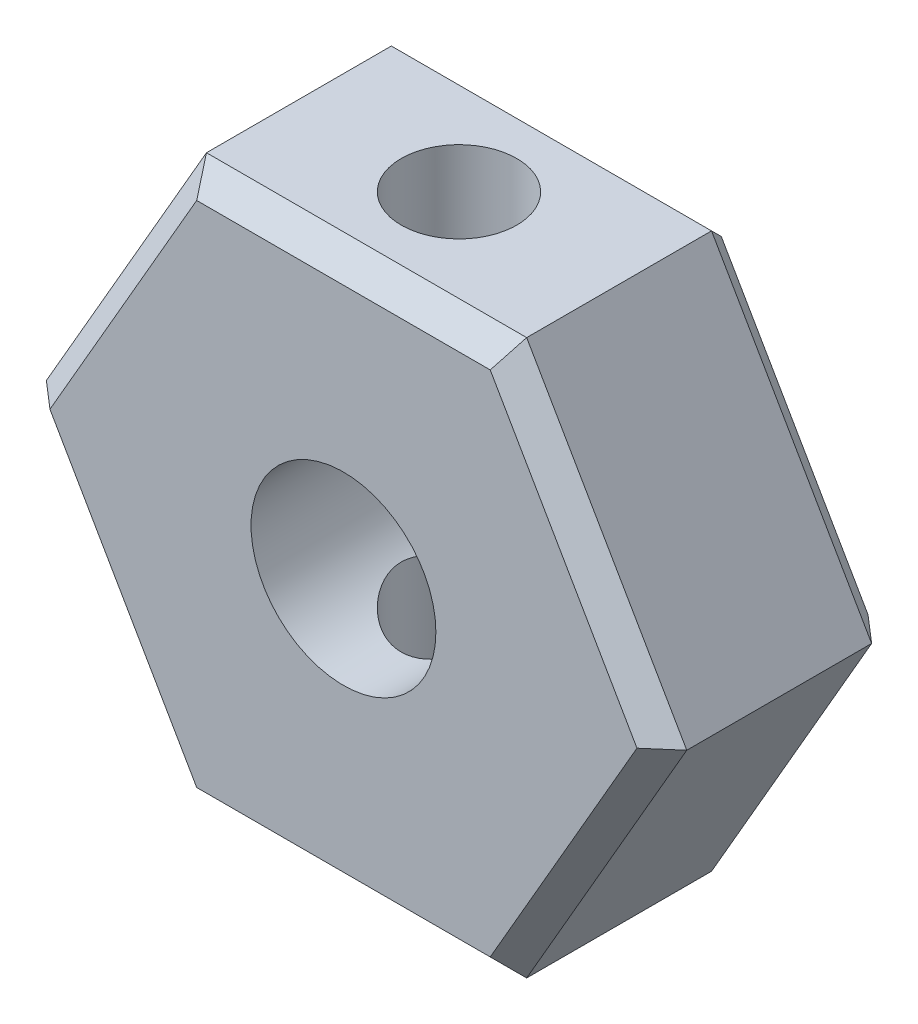
ISO-10303-21;
HEADER;
FILE_DESCRIPTION(('STEP AP214'),'2;1');
FILE_NAME('part.step','',(''),(''),'','','');
FILE_SCHEMA(('AUTOMOTIVE_DESIGN { 1 0 10303 214 1 1 1 1 }'));
ENDSEC;
DATA;
#1=APPLICATION_CONTEXT('core data for automotive mechanical design processes');
#2=APPLICATION_PROTOCOL_DEFINITION('international standard','automotive_design',2000,#1);
#3=PRODUCT_CONTEXT('',#1,'mechanical');
#4=PRODUCT('Part','Part','',(#3));
#5=PRODUCT_RELATED_PRODUCT_CATEGORY('part','',(#4));
#6=PRODUCT_DEFINITION_FORMATION('','',#4);
#7=PRODUCT_DEFINITION_CONTEXT('part definition',#1,'design');
#8=PRODUCT_DEFINITION('design','',#6,#7);
#9=PRODUCT_DEFINITION_SHAPE('','',#8);
#10=(LENGTH_UNIT() NAMED_UNIT(*) SI_UNIT(.MILLI.,.METRE.));
#11=(NAMED_UNIT(*) PLANE_ANGLE_UNIT() SI_UNIT($,.RADIAN.));
#12=(NAMED_UNIT(*) SI_UNIT($,.STERADIAN.) SOLID_ANGLE_UNIT());
#13=UNCERTAINTY_MEASURE_WITH_UNIT(LENGTH_MEASURE(1.E-05),#10,'distance_accuracy_value','');
#14=(GEOMETRIC_REPRESENTATION_CONTEXT(3) GLOBAL_UNCERTAINTY_ASSIGNED_CONTEXT((#13)) GLOBAL_UNIT_ASSIGNED_CONTEXT((#10,
#11,#12)) REPRESENTATION_CONTEXT('',''));
#15=CARTESIAN_POINT('',(0.,0.,0.));
#16=DIRECTION('',(0.,0.,1.));
#17=DIRECTION('',(1.,0.,0.));
#18=AXIS2_PLACEMENT_3D('',#15,#16,#17);
#19=CARTESIAN_POINT('',(3.46410161513776,-6.,5.));
#20=DIRECTION('',(-0.866025403784439,0.5,0.));
#21=DIRECTION('',(-0.5,-0.866025403784439,0.));
#22=AXIS2_PLACEMENT_3D('',#19,#20,#21);
#23=PLANE('',#22);
#24=DIRECTION('',(0.,0.,-1.));
#25=VECTOR('',#24,1.);
#26=CARTESIAN_POINT('',(3.46410161513776,-6.,5.));
#27=LINE('',#26,#25);
#28=CARTESIAN_POINT('',(3.46410161513776,-6.,4.49999999999999));
#29=VERTEX_POINT('',#28);
#30=CARTESIAN_POINT('',(3.46410161513776,-6.,0.499999999999998));
#31=VERTEX_POINT('',#30);
#32=EDGE_CURVE('E149',#29,#31,#27,.T.);
#33=ORIENTED_EDGE('',*,*,#32,.T.);
#34=DIRECTION('',(0.5,0.866025403784439,0.));
#35=VECTOR('',#34,1.);
#36=CARTESIAN_POINT('',(3.46410161513776,-6.,0.499999999999998));
#37=LINE('',#36,#35);
#38=CARTESIAN_POINT('',(6.92820323027551,0.,0.499999999999996));
#39=VERTEX_POINT('',#38);
#40=EDGE_CURVE('E151',#31,#39,#37,.T.);
#41=ORIENTED_EDGE('',*,*,#40,.T.);
#42=DIRECTION('',(0.,0.,-1.));
#43=VECTOR('',#42,1.);
#44=CARTESIAN_POINT('',(6.92820323027551,0.,5.));
#45=LINE('',#44,#43);
#46=CARTESIAN_POINT('',(6.92820323027551,0.,4.49999999999999));
#47=VERTEX_POINT('',#46);
#48=EDGE_CURVE('E144',#47,#39,#45,.T.);
#49=ORIENTED_EDGE('',*,*,#48,.F.);
#50=DIRECTION('',(-0.5,-0.866025403784439,0.));
#51=VECTOR('',#50,1.);
#52=CARTESIAN_POINT('',(3.46410161513776,-6.,4.49999999999999));
#53=LINE('',#52,#51);
#54=EDGE_CURVE('E129',#47,#29,#53,.T.);
#55=ORIENTED_EDGE('',*,*,#54,.T.);
#56=EDGE_LOOP('',(#33,#41,#49,#55));
#57=FACE_BOUND('',#56,.T.);
#58=ADVANCED_FACE('F32',(#57),#23,.F.);
#59=CARTESIAN_POINT('',(6.92820323027551,0.,5.));
#60=DIRECTION('',(-0.866025403784439,-0.5,0.));
#61=DIRECTION('',(0.5,-0.866025403784439,0.));
#62=AXIS2_PLACEMENT_3D('',#59,#60,#61);
#63=PLANE('',#62);
#64=ORIENTED_EDGE('',*,*,#48,.T.);
#65=DIRECTION('',(-0.5,0.866025403784439,0.));
#66=VECTOR('',#65,1.);
#67=CARTESIAN_POINT('',(6.92820323027551,0.,0.499999999999996));
#68=LINE('',#67,#66);
#69=CARTESIAN_POINT('',(3.46410161513776,6.,0.499999999999996));
#70=VERTEX_POINT('',#69);
#71=EDGE_CURVE('E204',#39,#70,#68,.T.);
#72=ORIENTED_EDGE('',*,*,#71,.T.);
#73=DIRECTION('',(0.,0.,-1.));
#74=VECTOR('',#73,1.);
#75=CARTESIAN_POINT('',(3.46410161513776,6.,5.));
#76=LINE('',#75,#74);
#77=CARTESIAN_POINT('',(3.46410161513776,6.,4.49999999999999));
#78=VERTEX_POINT('',#77);
#79=EDGE_CURVE('E172',#78,#70,#76,.T.);
#80=ORIENTED_EDGE('',*,*,#79,.F.);
#81=DIRECTION('',(0.5,-0.866025403784439,0.));
#82=VECTOR('',#81,1.);
#83=CARTESIAN_POINT('',(6.92820323027551,0.,4.49999999999999));
#84=LINE('',#83,#82);
#85=EDGE_CURVE('E202',#78,#47,#84,.T.);
#86=ORIENTED_EDGE('',*,*,#85,.T.);
#87=EDGE_LOOP('',(#64,#72,#80,#86));
#88=FACE_BOUND('',#87,.T.);
#89=ADVANCED_FACE('F260',(#88),#63,.F.);
#90=CARTESIAN_POINT('',(3.46410161513776,6.,5.));
#91=DIRECTION('',(0.,-1.,0.));
#92=DIRECTION('',(1.,0.,0.));
#93=AXIS2_PLACEMENT_3D('',#90,#91,#92);
#94=PLANE('',#93);
#95=CARTESIAN_POINT('',(0.,6.,2.5));
#96=DIRECTION('',(0.,1.,0.));
#97=DIRECTION('',(-1.,0.,0.));
#98=AXIS2_PLACEMENT_3D('',#95,#96,#97);
#99=CIRCLE('',#98,1.25);
#100=CARTESIAN_POINT('',(-1.25,6.,2.5));
#101=VERTEX_POINT('',#100);
#102=EDGE_CURVE('E384',#101,#101,#99,.T.);
#103=ORIENTED_EDGE('',*,*,#102,.F.);
#104=EDGE_LOOP('',(#103));
#105=FACE_BOUND('',#104,.T.);
#106=ORIENTED_EDGE('',*,*,#79,.T.);
#107=DIRECTION('',(-1.,0.,0.));
#108=VECTOR('',#107,1.);
#109=CARTESIAN_POINT('',(3.46410161513776,6.,0.499999999999997));
#110=LINE('',#109,#108);
#111=CARTESIAN_POINT('',(-3.46410161513776,6.,0.499999999999997));
#112=VERTEX_POINT('',#111);
#113=EDGE_CURVE('E200',#70,#112,#110,.T.);
#114=ORIENTED_EDGE('',*,*,#113,.T.);
#115=DIRECTION('',(0.,0.,-1.));
#116=VECTOR('',#115,1.);
#117=CARTESIAN_POINT('',(-3.46410161513776,6.,5.));
#118=LINE('',#117,#116);
#119=CARTESIAN_POINT('',(-3.46410161513776,6.,4.49999999999999));
#120=VERTEX_POINT('',#119);
#121=EDGE_CURVE('E169',#120,#112,#118,.T.);
#122=ORIENTED_EDGE('',*,*,#121,.F.);
#123=DIRECTION('',(1.,0.,0.));
#124=VECTOR('',#123,1.);
#125=CARTESIAN_POINT('',(3.46410161513776,6.,4.49999999999999));
#126=LINE('',#125,#124);
#127=EDGE_CURVE('E198',#120,#78,#126,.T.);
#128=ORIENTED_EDGE('',*,*,#127,.T.);
#129=EDGE_LOOP('',(#106,#114,#122,#128));
#130=FACE_BOUND('',#129,.T.);
#131=ADVANCED_FACE('F265',(#105,#130),#94,.F.);
#132=CARTESIAN_POINT('',(-3.46410161513776,6.,5.));
#133=DIRECTION('',(0.866025403784439,-0.5,0.));
#134=DIRECTION('',(0.5,0.866025403784439,0.));
#135=AXIS2_PLACEMENT_3D('',#132,#133,#134);
#136=PLANE('',#135);
#137=ORIENTED_EDGE('',*,*,#121,.T.);
#138=DIRECTION('',(-0.5,-0.866025403784439,0.));
#139=VECTOR('',#138,1.);
#140=CARTESIAN_POINT('',(-3.46410161513776,6.,0.499999999999997));
#141=LINE('',#140,#139);
#142=CARTESIAN_POINT('',(-6.92820323027551,0.,0.499999999999997));
#143=VERTEX_POINT('',#142);
#144=EDGE_CURVE('E196',#112,#143,#141,.T.);
#145=ORIENTED_EDGE('',*,*,#144,.T.);
#146=DIRECTION('',(0.,0.,-1.));
#147=VECTOR('',#146,1.);
#148=CARTESIAN_POINT('',(-6.92820323027551,0.,5.));
#149=LINE('',#148,#147);
#150=CARTESIAN_POINT('',(-6.92820323027551,0.,4.49999999999999));
#151=VERTEX_POINT('',#150);
#152=EDGE_CURVE('E160',#151,#143,#149,.T.);
#153=ORIENTED_EDGE('',*,*,#152,.F.);
#154=DIRECTION('',(0.5,0.866025403784439,0.));
#155=VECTOR('',#154,1.);
#156=CARTESIAN_POINT('',(-3.46410161513776,6.,4.49999999999999));
#157=LINE('',#156,#155);
#158=EDGE_CURVE('E194',#151,#120,#157,.T.);
#159=ORIENTED_EDGE('',*,*,#158,.T.);
#160=EDGE_LOOP('',(#137,#145,#153,#159));
#161=FACE_BOUND('',#160,.T.);
#162=ADVANCED_FACE('F321',(#161),#136,.F.);
#163=CARTESIAN_POINT('',(-6.92820323027551,0.,5.));
#164=DIRECTION('',(0.866025403784438,0.5,0.));
#165=DIRECTION('',(-0.5,0.866025403784439,0.));
#166=AXIS2_PLACEMENT_3D('',#163,#164,#165);
#167=PLANE('',#166);
#168=ORIENTED_EDGE('',*,*,#152,.T.);
#169=DIRECTION('',(0.5,-0.866025403784439,0.));
#170=VECTOR('',#169,1.);
#171=CARTESIAN_POINT('',(-6.92820323027551,0.,0.499999999999998));
#172=LINE('',#171,#170);
#173=CARTESIAN_POINT('',(-3.46410161513775,-6.,0.499999999999998));
#174=VERTEX_POINT('',#173);
#175=EDGE_CURVE('E192',#143,#174,#172,.T.);
#176=ORIENTED_EDGE('',*,*,#175,.T.);
#177=DIRECTION('',(0.,0.,-1.));
#178=VECTOR('',#177,1.);
#179=CARTESIAN_POINT('',(-3.46410161513775,-6.,5.));
#180=LINE('',#179,#178);
#181=CARTESIAN_POINT('',(-3.46410161513775,-6.,4.49999999999999));
#182=VERTEX_POINT('',#181);
#183=EDGE_CURVE('E157',#182,#174,#180,.T.);
#184=ORIENTED_EDGE('',*,*,#183,.F.);
#185=DIRECTION('',(-0.5,0.866025403784439,0.));
#186=VECTOR('',#185,1.);
#187=CARTESIAN_POINT('',(-6.92820323027551,0.,4.49999999999999));
#188=LINE('',#187,#186);
#189=EDGE_CURVE('E190',#182,#151,#188,.T.);
#190=ORIENTED_EDGE('',*,*,#189,.T.);
#191=EDGE_LOOP('',(#168,#176,#184,#190));
#192=FACE_BOUND('',#191,.T.);
#193=ADVANCED_FACE('F341',(#192),#167,.F.);
#194=CARTESIAN_POINT('',(-3.46410161513775,-6.,5.));
#195=DIRECTION('',(0.,1.,0.));
#196=DIRECTION('',(0.,0.,1.));
#197=AXIS2_PLACEMENT_3D('',#194,#195,#196);
#198=PLANE('',#197);
#199=CARTESIAN_POINT('',(0.,-6.00000000000001,2.5));
#200=DIRECTION('',(0.,1.,0.));
#201=DIRECTION('',(-1.,0.,0.));
#202=AXIS2_PLACEMENT_3D('',#199,#200,#201);
#203=CIRCLE('',#202,1.25);
#204=CARTESIAN_POINT('',(-1.25,-6.00000000000001,2.5));
#205=VERTEX_POINT('',#204);
#206=EDGE_CURVE('E243',#205,#205,#203,.T.);
#207=ORIENTED_EDGE('',*,*,#206,.T.);
#208=EDGE_LOOP('',(#207));
#209=FACE_BOUND('',#208,.T.);
#210=ORIENTED_EDGE('',*,*,#183,.T.);
#211=DIRECTION('',(1.,0.,0.));
#212=VECTOR('',#211,1.);
#213=CARTESIAN_POINT('',(-3.46410161513775,-6.,0.499999999999997));
#214=LINE('',#213,#212);
#215=EDGE_CURVE('E143',#174,#31,#214,.T.);
#216=ORIENTED_EDGE('',*,*,#215,.T.);
#217=ORIENTED_EDGE('',*,*,#32,.F.);
#218=DIRECTION('',(-1.,0.,0.));
#219=VECTOR('',#218,1.);
#220=CARTESIAN_POINT('',(-3.46410161513775,-6.,4.49999999999999));
#221=LINE('',#220,#219);
#222=EDGE_CURVE('E136',#29,#182,#221,.T.);
#223=ORIENTED_EDGE('',*,*,#222,.T.);
#224=EDGE_LOOP('',(#210,#216,#217,#223));
#225=FACE_BOUND('',#224,.T.);
#226=ADVANCED_FACE('F155',(#209,#225),#198,.F.);
#227=CARTESIAN_POINT('',(0.,0.,5.));
#228=DIRECTION('',(0.,0.,1.));
#229=DIRECTION('',(1.,0.,0.));
#230=AXIS2_PLACEMENT_3D('',#227,#228,#229);
#231=PLANE('',#230);
#232=DIRECTION('',(1.,0.,0.));
#233=VECTOR('',#232,1.);
#234=CARTESIAN_POINT('',(3.46410161513776,-5.5,5.));
#235=LINE('',#234,#233);
#236=CARTESIAN_POINT('',(-3.17542648054294,-5.5,5.));
#237=VERTEX_POINT('',#236);
#238=CARTESIAN_POINT('',(3.17542648054294,-5.5,5.));
#239=VERTEX_POINT('',#238);
#240=EDGE_CURVE('E45',#237,#239,#235,.T.);
#241=ORIENTED_EDGE('',*,*,#240,.T.);
#242=DIRECTION('',(0.5,0.866025403784439,0.));
#243=VECTOR('',#242,1.);
#244=CARTESIAN_POINT('',(6.49519052838329,0.250000000000003,5.));
#245=LINE('',#244,#243);
#246=CARTESIAN_POINT('',(6.35085296108589,0.,5.));
#247=VERTEX_POINT('',#246);
#248=EDGE_CURVE('E11',#239,#247,#245,.T.);
#249=ORIENTED_EDGE('',*,*,#248,.T.);
#250=DIRECTION('',(-0.5,0.866025403784439,0.));
#251=VECTOR('',#250,1.);
#252=CARTESIAN_POINT('',(3.03108891324554,5.75,5.));
#253=LINE('',#252,#251);
#254=CARTESIAN_POINT('',(3.17542648054294,5.5,5.));
#255=VERTEX_POINT('',#254);
#256=EDGE_CURVE('E206',#247,#255,#253,.T.);
#257=ORIENTED_EDGE('',*,*,#256,.T.);
#258=DIRECTION('',(-1.,0.,0.));
#259=VECTOR('',#258,1.);
#260=CARTESIAN_POINT('',(-3.46410161513776,5.5,5.));
#261=LINE('',#260,#259);
#262=CARTESIAN_POINT('',(-3.17542648054295,5.5,5.));
#263=VERTEX_POINT('',#262);
#264=EDGE_CURVE('E208',#255,#263,#261,.T.);
#265=ORIENTED_EDGE('',*,*,#264,.T.);
#266=DIRECTION('',(-0.5,-0.866025403784439,0.));
#267=VECTOR('',#266,1.);
#268=CARTESIAN_POINT('',(-6.49519052838329,-0.250000000000002,5.));
#269=LINE('',#268,#267);
#270=CARTESIAN_POINT('',(-6.35085296108588,0.,5.));
#271=VERTEX_POINT('',#270);
#272=EDGE_CURVE('E210',#263,#271,#269,.T.);
#273=ORIENTED_EDGE('',*,*,#272,.T.);
#274=DIRECTION('',(0.5,-0.866025403784439,0.));
#275=VECTOR('',#274,1.);
#276=CARTESIAN_POINT('',(-3.03108891324553,-5.75,5.));
#277=LINE('',#276,#275);
#278=EDGE_CURVE('E56',#271,#237,#277,.T.);
#279=ORIENTED_EDGE('',*,*,#278,.T.);
#280=EDGE_LOOP('',(#241,#249,#257,#265,#273,#279));
#281=FACE_BOUND('',#280,.T.);
#282=CARTESIAN_POINT('',(0.,0.,5.));
#283=DIRECTION('',(0.,0.,1.));
#284=DIRECTION('',(1.,0.,0.));
#285=AXIS2_PLACEMENT_3D('',#282,#283,#284);
#286=CIRCLE('',#285,2.);
#287=CARTESIAN_POINT('',(2.,0.,5.));
#288=VERTEX_POINT('',#287);
#289=EDGE_CURVE('E163',#288,#288,#286,.T.);
#290=ORIENTED_EDGE('',*,*,#289,.F.);
#291=EDGE_LOOP('',(#290));
#292=FACE_BOUND('',#291,.T.);
#293=ADVANCED_FACE('F350',(#281,#292),#231,.T.);
#294=CARTESIAN_POINT('',(0.,0.,0.));
#295=DIRECTION('',(0.,0.,1.));
#296=DIRECTION('',(1.,0.,0.));
#297=AXIS2_PLACEMENT_3D('',#294,#295,#296);
#298=PLANE('',#297);
#299=DIRECTION('',(-0.5,-0.866025403784439,0.));
#300=VECTOR('',#299,1.);
#301=CARTESIAN_POINT('',(4.76313972081442,-2.75,0.));
#302=LINE('',#301,#300);
#303=CARTESIAN_POINT('',(6.35085296108589,0.,0.));
#304=VERTEX_POINT('',#303);
#305=CARTESIAN_POINT('',(3.17542648054294,-5.5,0.));
#306=VERTEX_POINT('',#305);
#307=EDGE_CURVE('E185',#304,#306,#302,.T.);
#308=ORIENTED_EDGE('',*,*,#307,.T.);
#309=DIRECTION('',(-1.,0.,0.));
#310=VECTOR('',#309,1.);
#311=CARTESIAN_POINT('',(0.,-5.5,0.));
#312=LINE('',#311,#310);
#313=CARTESIAN_POINT('',(-3.17542648054294,-5.5,0.));
#314=VERTEX_POINT('',#313);
#315=EDGE_CURVE('E152',#306,#314,#312,.T.);
#316=ORIENTED_EDGE('',*,*,#315,.T.);
#317=DIRECTION('',(-0.5,0.866025403784439,0.));
#318=VECTOR('',#317,1.);
#319=CARTESIAN_POINT('',(-4.76313972081442,-2.75,0.));
#320=LINE('',#319,#318);
#321=CARTESIAN_POINT('',(-6.35085296108589,0.,0.));
#322=VERTEX_POINT('',#321);
#323=EDGE_CURVE('E183',#314,#322,#320,.T.);
#324=ORIENTED_EDGE('',*,*,#323,.T.);
#325=DIRECTION('',(0.5,0.866025403784439,0.));
#326=VECTOR('',#325,1.);
#327=CARTESIAN_POINT('',(-4.76313972081442,2.75,0.));
#328=LINE('',#327,#326);
#329=CARTESIAN_POINT('',(-3.17542648054295,5.5,0.));
#330=VERTEX_POINT('',#329);
#331=EDGE_CURVE('E181',#322,#330,#328,.T.);
#332=ORIENTED_EDGE('',*,*,#331,.T.);
#333=DIRECTION('',(1.,0.,0.));
#334=VECTOR('',#333,1.);
#335=CARTESIAN_POINT('',(0.,5.5,0.));
#336=LINE('',#335,#334);
#337=CARTESIAN_POINT('',(3.17542648054294,5.5,0.));
#338=VERTEX_POINT('',#337);
#339=EDGE_CURVE('E179',#330,#338,#336,.T.);
#340=ORIENTED_EDGE('',*,*,#339,.T.);
#341=DIRECTION('',(0.5,-0.866025403784439,0.));
#342=VECTOR('',#341,1.);
#343=CARTESIAN_POINT('',(4.76313972081442,2.75,0.));
#344=LINE('',#343,#342);
#345=EDGE_CURVE('E177',#338,#304,#344,.T.);
#346=ORIENTED_EDGE('',*,*,#345,.T.);
#347=EDGE_LOOP('',(#308,#316,#324,#332,#340,#346));
#348=FACE_BOUND('',#347,.T.);
#349=CARTESIAN_POINT('',(0.,0.,0.));
#350=DIRECTION('',(0.,0.,1.));
#351=DIRECTION('',(1.,0.,0.));
#352=AXIS2_PLACEMENT_3D('',#349,#350,#351);
#353=CIRCLE('',#352,2.);
#354=CARTESIAN_POINT('',(2.,0.,0.));
#355=VERTEX_POINT('',#354);
#356=EDGE_CURVE('E158',#355,#355,#353,.T.);
#357=ORIENTED_EDGE('',*,*,#356,.T.);
#358=EDGE_LOOP('',(#357));
#359=FACE_BOUND('',#358,.T.);
#360=ADVANCED_FACE('F334',(#348,#359),#298,.F.);
#361=CARTESIAN_POINT('',(0.,0.,0.));
#362=DIRECTION('',(0.,0.,1.));
#363=DIRECTION('',(1.,0.,0.));
#364=AXIS2_PLACEMENT_3D('',#361,#362,#363);
#365=CYLINDRICAL_SURFACE('',#364,2.);
#366=CARTESIAN_POINT('',(-1.25,-1.5612494995996,2.5));
#367=CARTESIAN_POINT('',(-1.24999462210485,-1.56125800072558,2.43787971819707));
#368=CARTESIAN_POINT('',(-1.24532693849665,-1.56502642708837,2.37566216462974));
#369=CARTESIAN_POINT('',(-1.22698950832934,-1.57943717205478,2.25332367992062));
#370=CARTESIAN_POINT('',(-1.21329530430551,-1.59009816464115,2.19320891363476));
#371=CARTESIAN_POINT('',(-1.17788073911871,-1.61650085329041,2.07721767730115));
#372=CARTESIAN_POINT('',(-1.15622993332784,-1.63219837418033,2.02130939131818));
#373=CARTESIAN_POINT('',(-1.10571945561924,-1.66682950714432,1.91399113836184));
#374=CARTESIAN_POINT('',(-1.07685958706091,-1.68576320748676,1.86258129414349));
#375=CARTESIAN_POINT('',(-1.00823937928364,-1.72779611374711,1.75813484552301));
#376=CARTESIAN_POINT('',(-0.967536093692501,-1.75111338227346,1.7058052591674));
#377=CARTESIAN_POINT('',(-0.878308664496878,-1.79752820854877,1.60811730085503));
#378=CARTESIAN_POINT('',(-0.829777781297412,-1.82062555863329,1.56276500271607));
#379=CARTESIAN_POINT('',(-0.719186665258489,-1.86729453891009,1.47489641485187));
#380=CARTESIAN_POINT('',(-0.656200568910555,-1.8905872224145,1.43338233189569));
#381=CARTESIAN_POINT('',(-0.522404070837314,-1.9318323169914,1.36187479523684));
#382=CARTESIAN_POINT('',(-0.45160150647824,-1.94979001179838,1.33186993424874));
#383=CARTESIAN_POINT('',(-0.311776878362017,-1.97669841318201,1.28751768939293));
#384=CARTESIAN_POINT('',(-0.243305636047239,-1.98637922422038,1.27188858360306));
#385=CARTESIAN_POINT('',(-0.104105100662262,-1.99850544379202,1.25236793035659));
#386=CARTESIAN_POINT('',(-0.0333782605640252,-2.00095845843657,1.24846404387944));
#387=CARTESIAN_POINT('',(0.098065828421342,-1.99852909107528,1.25235568927761));
#388=CARTESIAN_POINT('',(0.158852523273788,-1.99458699811902,1.2586513763009));
#389=CARTESIAN_POINT('',(0.278306645903671,-1.98145272261225,1.27986698436332));
#390=CARTESIAN_POINT('',(0.336973913146976,-1.97226014325117,1.29478755723751));
#391=CARTESIAN_POINT('',(0.450889117077074,-1.94938133614675,1.33260377509711));
#392=CARTESIAN_POINT('',(0.506127875493235,-1.93568361673912,1.35551982404859));
#393=CARTESIAN_POINT('',(0.612019220469384,-1.90485632889331,1.40846875525999));
#394=CARTESIAN_POINT('',(0.662670758560003,-1.88772597874226,1.4385032588906));
#395=CARTESIAN_POINT('',(0.764713515567043,-1.84893224750793,1.50902816532936));
#396=CARTESIAN_POINT('',(0.815412344918951,-1.82697004307144,1.55035462674233));
#397=CARTESIAN_POINT('',(0.9095985959055,-1.78195462752237,1.64013238022337));
#398=CARTESIAN_POINT('',(0.953075338789634,-1.75889986449171,1.68859402644654));
#399=CARTESIAN_POINT('',(1.03735445892932,-1.71071442112195,1.7987056229061));
#400=CARTESIAN_POINT('',(1.07706615479947,-1.68570581533195,1.8612513808503));
#401=CARTESIAN_POINT('',(1.14526153203309,-1.64014139095399,1.99364611977342));
#402=CARTESIAN_POINT('',(1.17376589603358,-1.61957740191679,2.06348134395541));
#403=CARTESIAN_POINT('',(1.21218566853166,-1.5909187656712,2.18976940288787));
#404=CARTESIAN_POINT('',(1.22501841721721,-1.58096704305272,2.24491096263767));
#405=CARTESIAN_POINT('',(1.24310168537523,-1.56679138875765,2.35711518874893));
#406=CARTESIAN_POINT('',(1.24836256353275,-1.56255963237428,2.41417512103989));
#407=CARTESIAN_POINT('',(1.25098535954508,-1.56046133530164,2.52872868054027));
#408=CARTESIAN_POINT('',(1.24832917576576,-1.56260938140435,2.58622300136582));
#409=CARTESIAN_POINT('',(1.23525733555987,-1.57296042862705,2.6997805810316));
#410=CARTESIAN_POINT('',(1.22483525320262,-1.58116844404656,2.75584261496292));
#411=CARTESIAN_POINT('',(1.1970493572483,-1.60230060601957,2.8642183838658));
#412=CARTESIAN_POINT('',(1.17980280626788,-1.61514477937171,2.91657867333151));
#413=CARTESIAN_POINT('',(1.13902451938523,-1.64415573440841,3.01778733455698));
#414=CARTESIAN_POINT('',(1.11549055271421,-1.66032369489908,3.06663445202449));
#415=CARTESIAN_POINT('',(1.0576537677232,-1.69787203988937,3.16930603917703));
#416=CARTESIAN_POINT('',(1.02215373814221,-1.71965875738289,3.22230754124932));
#417=CARTESIAN_POINT('',(0.943690263224863,-1.76393958000711,3.32218505243914));
#418=CARTESIAN_POINT('',(0.900719074496601,-1.78643439903354,3.36905461697796));
#419=CARTESIAN_POINT('',(0.800380659499195,-1.83383164018972,3.46298324624315));
#420=CARTESIAN_POINT('',(0.741809949714164,-1.85854204787597,3.50886855700767));
#421=CARTESIAN_POINT('',(0.616299987869578,-1.90384248964999,3.59006865187585));
#422=CARTESIAN_POINT('',(0.549364678748662,-1.92443445329133,3.62538838997364));
#423=CARTESIAN_POINT('',(0.4129259006366,-1.95809255957561,3.68199499120263));
#424=CARTESIAN_POINT('',(0.343814822544519,-1.9715348458918,3.70399420647076));
#425=CARTESIAN_POINT('',(0.201860998884746,-1.9910701008804,3.73572666868108));
#426=CARTESIAN_POINT('',(0.129023563238367,-1.99717323933003,3.74547688976111));
#427=CARTESIAN_POINT('',(-0.00659907199681211,-2.00096685748559,3.75154652003878));
#428=CARTESIAN_POINT('',(-0.0692812975954738,-1.99976600623617,3.74963577678698));
#429=CARTESIAN_POINT('',(-0.193279811091725,-1.99160739958772,3.73653832502566));
#430=CARTESIAN_POINT('',(-0.254596160840743,-1.98464990541518,3.72535203742423));
#431=CARTESIAN_POINT('',(-0.372043294685526,-1.9659610468898,3.6948395251234));
#432=CARTESIAN_POINT('',(-0.428280180678309,-1.95440367471701,3.67580916012679));
#433=CARTESIAN_POINT('',(-0.536714369111315,-1.92744968677265,3.63044007183593));
#434=CARTESIAN_POINT('',(-0.58891098811824,-1.91205242331406,3.60410011552441));
#435=CARTESIAN_POINT('',(-0.693656737470666,-1.87675342239825,3.54183942100879));
#436=CARTESIAN_POINT('',(-0.745680127162211,-1.85655002466956,3.50520801868101));
#437=CARTESIAN_POINT('',(-0.843216608355413,-1.81433640456238,3.4249233696673));
#438=CARTESIAN_POINT('',(-0.88872224305523,-1.7923241573062,3.38126219975405));
#439=CARTESIAN_POINT('',(-0.978723601300805,-1.74500415099525,3.28088373769672));
#440=CARTESIAN_POINT('',(-1.02212829873816,-1.71967871446314,3.22319165482308));
#441=CARTESIAN_POINT('',(-1.09877325005744,-1.67174821497037,3.10035533398988));
#442=CARTESIAN_POINT('',(-1.132019125571,-1.64914165167051,3.0352152450924));
#443=CARTESIAN_POINT('',(-1.18099110923231,-1.61429776080214,2.91359723207033));
#444=CARTESIAN_POINT('',(-1.19896216276381,-1.60087340349652,2.85836431912063));
#445=CARTESIAN_POINT('',(-1.22712822180407,-1.57939158437939,2.7450307220428));
#446=CARTESIAN_POINT('',(-1.23734784245404,-1.57131714400176,2.68693974497585));
#447=CARTESIAN_POINT('',(-1.24559906183097,-1.56476456389394,2.60696947613714));
#448=CARTESIAN_POINT('',(-1.24724671259581,-1.56345069546827,2.58563585448301));
#449=CARTESIAN_POINT('',(-1.24944824734288,-1.56169158695047,2.54287203347851));
#450=CARTESIAN_POINT('',(-1.25000185626673,-1.56124656529967,2.52144181119831));
#451=CARTESIAN_POINT('',(-1.25,-1.5612494995996,2.5));
#452=B_SPLINE_CURVE_WITH_KNOTS('',3,(#366,#367,#368,#369,#370,#371,#372,#373,#374,#375,#376,
#377,#378,#379,#380,#381,#382,#383,#384,#385,#386,#387,#388,#389,#390,#391,#392,#393,#394,#395,
#396,#397,#398,#399,#400,#401,#402,#403,#404,#405,#406,#407,#408,#409,#410,#411,#412,#413,#414,
#415,#416,#417,#418,#419,#420,#421,#422,#423,#424,#425,#426,#427,#428,#429,#430,#431,#432,#433,
#434,#435,#436,#437,#438,#439,#440,#441,#442,#443,#444,#445,#446,#447,#448,#449,#450,#451),
.UNSPECIFIED.,.T.,.F.,(4,2,2,2,2,2,2,2,2,2,2,2,2,2,2,2,2,2,2,2,2,2,2,2,2,2,2,2,2,2,2,2,2,2,2,2,
2,2,2,2,2,2,4),(0.,0.186262444012015,0.373031654397096,0.558205556130402,0.743384509377751,
0.953406207440074,1.16360970997911,1.39917236034457,1.6345009273926,1.84590412815398,
2.05708478092387,2.23992319583511,2.42277543076414,2.60609774825956,2.78946186128171,
2.99564504832107,3.20213044016186,3.43558067920821,3.66859805095278,3.84032775480268,
4.01182230007289,4.18370925240739,4.35573859160081,4.52493212343598,4.69418576487135,
4.89566333610129,5.09735098485254,5.33136598660889,5.56527109061626,5.78520080494549,
6.00482541258961,6.19203601525124,6.37923812308583,6.55994569114424,6.74068376037881,
6.94018144108746,7.13990556958868,7.36841817421249,7.59680409585386,7.77496902270413,
7.95256577963385,8.01684109069498,8.08113255947023),.UNSPECIFIED.);
#453=CARTESIAN_POINT('',(-1.25,-1.5612494995996,2.5));
#454=VERTEX_POINT('',#453);
#455=EDGE_CURVE('E36',#454,#454,#452,.T.);
#456=ORIENTED_EDGE('',*,*,#455,.T.);
#457=EDGE_LOOP('',(#456));
#458=FACE_BOUND('',#457,.T.);
#459=CARTESIAN_POINT('',(-1.25,1.5612494995996,2.5));
#460=CARTESIAN_POINT('',(-1.24999462210485,1.56125800072559,2.56212028180293));
#461=CARTESIAN_POINT('',(-1.24532693849666,1.56502642708837,2.62433783537025));
#462=CARTESIAN_POINT('',(-1.22698950832934,1.57943717205478,2.74667632007937));
#463=CARTESIAN_POINT('',(-1.21329530430551,1.59009816464115,2.80679108636523));
#464=CARTESIAN_POINT('',(-1.17788073911871,1.61650085329041,2.92278232269884));
#465=CARTESIAN_POINT('',(-1.15622993332784,1.63219837418033,2.97869060868181));
#466=CARTESIAN_POINT('',(-1.10571945561924,1.66682950714432,3.08600886163815));
#467=CARTESIAN_POINT('',(-1.07685958706091,1.68576320748676,3.1374187058565));
#468=CARTESIAN_POINT('',(-1.00823937928364,1.72779611374711,3.24186515447698));
#469=CARTESIAN_POINT('',(-0.967536093692502,1.75111338227346,3.29419474083259));
#470=CARTESIAN_POINT('',(-0.878308664496879,1.79752820854877,3.39188269914496));
#471=CARTESIAN_POINT('',(-0.829777781297413,1.82062555863329,3.43723499728392));
#472=CARTESIAN_POINT('',(-0.719186665258491,1.86729453891009,3.52510358514812));
#473=CARTESIAN_POINT('',(-0.656200568910556,1.8905872224145,3.5666176681043));
#474=CARTESIAN_POINT('',(-0.522404070837315,1.9318323169914,3.63812520476316));
#475=CARTESIAN_POINT('',(-0.451601506478241,1.94979001179838,3.66813006575125));
#476=CARTESIAN_POINT('',(-0.311776878362018,1.97669841318201,3.71248231060706));
#477=CARTESIAN_POINT('',(-0.243305636047241,1.98637922422038,3.72811141639693));
#478=CARTESIAN_POINT('',(-0.104105100662263,1.99850544379202,3.7476320696434));
#479=CARTESIAN_POINT('',(-0.0333782605640266,2.00095845843657,3.75153595612055));
#480=CARTESIAN_POINT('',(0.0980658284213406,1.99852909107528,3.74764431072238));
#481=CARTESIAN_POINT('',(0.158852523273786,1.99458699811902,3.74134862369909));
#482=CARTESIAN_POINT('',(0.27830664590367,1.98145272261225,3.72013301563667));
#483=CARTESIAN_POINT('',(0.336973913146974,1.97226014325117,3.70521244276248));
#484=CARTESIAN_POINT('',(0.450889117077073,1.94938133614675,3.66739622490288));
#485=CARTESIAN_POINT('',(0.506127875493233,1.93568361673912,3.64448017595141));
#486=CARTESIAN_POINT('',(0.612019220469382,1.90485632889331,3.59153124474001));
#487=CARTESIAN_POINT('',(0.662670758560001,1.88772597874226,3.56149674110939));
#488=CARTESIAN_POINT('',(0.764713515567042,1.84893224750793,3.49097183467063));
#489=CARTESIAN_POINT('',(0.81541234491895,1.82697004307144,3.44964537325766));
#490=CARTESIAN_POINT('',(0.909598595905499,1.78195462752237,3.35986761977662));
#491=CARTESIAN_POINT('',(0.953075338789632,1.75889986449171,3.31140597355345));
#492=CARTESIAN_POINT('',(1.03735445892932,1.71071442112195,3.20129437709389));
#493=CARTESIAN_POINT('',(1.07706615479946,1.68570581533195,3.13874861914969));
#494=CARTESIAN_POINT('',(1.14526153203309,1.64014139095399,3.00635388022657));
#495=CARTESIAN_POINT('',(1.17376589603358,1.6195774019168,2.93651865604458));
#496=CARTESIAN_POINT('',(1.21218566853166,1.5909187656712,2.81023059711212));
#497=CARTESIAN_POINT('',(1.22501841721721,1.58096704305272,2.75508903736232));
#498=CARTESIAN_POINT('',(1.24310168537523,1.56679138875765,2.64288481125106));
#499=CARTESIAN_POINT('',(1.24836256353275,1.56255963237428,2.5858248789601));
#500=CARTESIAN_POINT('',(1.25098535954508,1.56046133530164,2.47127131945973));
#501=CARTESIAN_POINT('',(1.24832917576576,1.56260938140435,2.41377699863418));
#502=CARTESIAN_POINT('',(1.23525733555987,1.57296042862705,2.30021941896839));
#503=CARTESIAN_POINT('',(1.22483525320262,1.58116844404657,2.24415738503707));
#504=CARTESIAN_POINT('',(1.1970493572483,1.60230060601957,2.13578161613419));
#505=CARTESIAN_POINT('',(1.17980280626788,1.61514477937171,2.08342132666848));
#506=CARTESIAN_POINT('',(1.13902451938523,1.64415573440841,1.98221266544302));
#507=CARTESIAN_POINT('',(1.11549055271421,1.66032369489908,1.9333655479755));
#508=CARTESIAN_POINT('',(1.0576537677232,1.69787203988937,1.83069396082297));
#509=CARTESIAN_POINT('',(1.02215373814221,1.71965875738289,1.77769245875067));
#510=CARTESIAN_POINT('',(0.943690263224863,1.76393958000711,1.67781494756085));
#511=CARTESIAN_POINT('',(0.900719074496601,1.78643439903354,1.63094538302203));
#512=CARTESIAN_POINT('',(0.800380659499194,1.83383164018972,1.53701675375684));
#513=CARTESIAN_POINT('',(0.741809949714164,1.85854204787597,1.49113144299232));
#514=CARTESIAN_POINT('',(0.616299987869578,1.90384248964999,1.40993134812414));
#515=CARTESIAN_POINT('',(0.549364678748663,1.92443445329133,1.37461161002636));
#516=CARTESIAN_POINT('',(0.4129259006366,1.95809255957561,1.31800500879736));
#517=CARTESIAN_POINT('',(0.34381482254452,1.9715348458918,1.29600579352923));
#518=CARTESIAN_POINT('',(0.201860998884747,1.9910701008804,1.26427333131891));
#519=CARTESIAN_POINT('',(0.129023563238367,1.99717323933003,1.25452311023888));
#520=CARTESIAN_POINT('',(-0.00659907199681228,2.00096685748559,1.24845347996121));
#521=CARTESIAN_POINT('',(-0.0692812975954743,1.99976600623617,1.25036422321301));
#522=CARTESIAN_POINT('',(-0.193279811091726,1.99160739958772,1.26346167497433));
#523=CARTESIAN_POINT('',(-0.254596160840743,1.98464990541518,1.27464796257576));
#524=CARTESIAN_POINT('',(-0.372043294685526,1.9659610468898,1.30516047487659));
#525=CARTESIAN_POINT('',(-0.428280180678309,1.95440367471701,1.3241908398732));
#526=CARTESIAN_POINT('',(-0.536714369111314,1.92744968677265,1.36955992816406));
#527=CARTESIAN_POINT('',(-0.588910988118239,1.91205242331406,1.39589988447558));
#528=CARTESIAN_POINT('',(-0.693656737470667,1.87675342239825,1.4581605789912));
#529=CARTESIAN_POINT('',(-0.745680127162212,1.85655002466956,1.49479198131898));
#530=CARTESIAN_POINT('',(-0.843216608355414,1.81433640456238,1.5750766303327));
#531=CARTESIAN_POINT('',(-0.88872224305523,1.7923241573062,1.61873780024594));
#532=CARTESIAN_POINT('',(-0.978723601300805,1.74500415099525,1.71911626230327));
#533=CARTESIAN_POINT('',(-1.02212829873816,1.71967871446314,1.77680834517691));
#534=CARTESIAN_POINT('',(-1.09877325005744,1.67174821497037,1.89964466601011));
#535=CARTESIAN_POINT('',(-1.132019125571,1.64914165167051,1.96478475490759));
#536=CARTESIAN_POINT('',(-1.18099110923231,1.61429776080214,2.08640276792966));
#537=CARTESIAN_POINT('',(-1.19896216276381,1.60087340349652,2.14163568087936));
#538=CARTESIAN_POINT('',(-1.22712822180408,1.57939158437939,2.25496927795719));
#539=CARTESIAN_POINT('',(-1.23734784245404,1.57131714400176,2.31306025502414));
#540=CARTESIAN_POINT('',(-1.24559906183097,1.56476456389394,2.39303052386285));
#541=CARTESIAN_POINT('',(-1.24724671259581,1.56345069546827,2.41436414551698));
#542=CARTESIAN_POINT('',(-1.24944824734288,1.56169158695047,2.45712796652148));
#543=CARTESIAN_POINT('',(-1.25000185626673,1.56124656529967,2.47855818880168));
#544=CARTESIAN_POINT('',(-1.25,1.5612494995996,2.5));
#545=B_SPLINE_CURVE_WITH_KNOTS('',3,(#459,#460,#461,#462,#463,#464,#465,#466,#467,#468,#469,
#470,#471,#472,#473,#474,#475,#476,#477,#478,#479,#480,#481,#482,#483,#484,#485,#486,#487,#488,
#489,#490,#491,#492,#493,#494,#495,#496,#497,#498,#499,#500,#501,#502,#503,#504,#505,#506,#507,
#508,#509,#510,#511,#512,#513,#514,#515,#516,#517,#518,#519,#520,#521,#522,#523,#524,#525,#526,
#527,#528,#529,#530,#531,#532,#533,#534,#535,#536,#537,#538,#539,#540,#541,#542,#543,#544),
.UNSPECIFIED.,.T.,.F.,(4,2,2,2,2,2,2,2,2,2,2,2,2,2,2,2,2,2,2,2,2,2,2,2,2,2,2,2,2,2,2,2,2,2,2,2,
2,2,2,2,2,2,4),(0.,0.186262444012015,0.373031654397095,0.558205556130401,0.74338450937775,
0.953406207440073,1.16360970997911,1.39917236034457,1.6345009273926,1.84590412815398,
2.05708478092387,2.23992319583511,2.42277543076414,2.60609774825956,2.78946186128171,
2.99564504832107,3.20213044016186,3.43558067920821,3.66859805095277,3.84032775480268,
4.01182230007289,4.18370925240739,4.35573859160081,4.52493212343598,4.69418576487135,
4.89566333610128,5.09735098485254,5.33136598660889,5.56527109061626,5.78520080494549,
6.00482541258961,6.19203601525124,6.37923812308583,6.55994569114424,6.74068376037881,
6.94018144108745,7.13990556958868,7.36841817421249,7.59680409585386,7.77496902270413,
7.95256577963385,8.01684109069498,8.08113255947023),.UNSPECIFIED.);
#546=CARTESIAN_POINT('',(-1.25,1.5612494995996,2.5));
#547=VERTEX_POINT('',#546);
#548=EDGE_CURVE('E239',#547,#547,#545,.T.);
#549=ORIENTED_EDGE('',*,*,#548,.T.);
#550=EDGE_LOOP('',(#549));
#551=FACE_BOUND('',#550,.T.);
#552=ORIENTED_EDGE('',*,*,#356,.F.);
#553=EDGE_LOOP('',(#552));
#554=FACE_BOUND('',#553,.T.);
#555=ORIENTED_EDGE('',*,*,#289,.T.);
#556=EDGE_LOOP('',(#555));
#557=FACE_BOUND('',#556,.T.);
#558=ADVANCED_FACE('F244',(#458,#551,#554,#557),#365,.F.);
#559=CARTESIAN_POINT('',(3.46410161513776,6.,0.499999999999997));
#560=DIRECTION('',(0.,-0.707106781186545,0.70710678118655));
#561=DIRECTION('',(-1.,0.,0.));
#562=AXIS2_PLACEMENT_3D('',#559,#560,#561);
#563=PLANE('',#562);
#564=DIRECTION('',(0.37796447300923,0.654653670707979,0.654653670707974));
#565=VECTOR('',#564,1.);
#566=CARTESIAN_POINT('',(2.47435829652696,4.28571428571428,-1.21428571428571));
#567=LINE('',#566,#565);
#568=EDGE_CURVE('E225',#338,#70,#567,.T.);
#569=ORIENTED_EDGE('',*,*,#568,.F.);
#570=ORIENTED_EDGE('',*,*,#339,.F.);
#571=DIRECTION('',(-0.377964473009228,0.654653670707979,0.654653670707975));
#572=VECTOR('',#571,1.);
#573=CARTESIAN_POINT('',(-2.47435829652697,4.28571428571428,-1.21428571428572));
#574=LINE('',#573,#572);
#575=EDGE_CURVE('E228',#112,#330,#574,.F.);
#576=ORIENTED_EDGE('',*,*,#575,.F.);
#577=ORIENTED_EDGE('',*,*,#113,.F.);
#578=EDGE_LOOP('',(#569,#570,#576,#577));
#579=FACE_BOUND('',#578,.T.);
#580=ADVANCED_FACE('F289',(#579),#563,.F.);
#581=CARTESIAN_POINT('',(-3.46410161513776,6.,0.499999999999997));
#582=DIRECTION('',(0.612372435695793,-0.353553390593272,0.70710678118655));
#583=DIRECTION('',(-0.5,-0.866025403784439,0.));
#584=AXIS2_PLACEMENT_3D('',#581,#582,#583);
#585=PLANE('',#584);
#586=ORIENTED_EDGE('',*,*,#575,.T.);
#587=ORIENTED_EDGE('',*,*,#331,.F.);
#588=DIRECTION('',(-0.755928946018457,0.,0.654653670707975));
#589=VECTOR('',#588,1.);
#590=CARTESIAN_POINT('',(-4.94871659305393,0.,-1.21428571428572));
#591=LINE('',#590,#589);
#592=EDGE_CURVE('E222',#143,#322,#591,.F.);
#593=ORIENTED_EDGE('',*,*,#592,.F.);
#594=ORIENTED_EDGE('',*,*,#144,.F.);
#595=EDGE_LOOP('',(#586,#587,#593,#594));
#596=FACE_BOUND('',#595,.T.);
#597=ADVANCED_FACE('F285',(#596),#585,.F.);
#598=CARTESIAN_POINT('',(6.92820323027551,0.,0.499999999999997));
#599=DIRECTION('',(-0.612372435695792,-0.353553390593272,0.707106781186551));
#600=DIRECTION('',(-0.5,0.866025403784439,0.));
#601=AXIS2_PLACEMENT_3D('',#598,#599,#600);
#602=PLANE('',#601);
#603=ORIENTED_EDGE('',*,*,#568,.T.);
#604=ORIENTED_EDGE('',*,*,#71,.F.);
#605=DIRECTION('',(-0.755928946018457,0.,-0.654653670707974));
#606=VECTOR('',#605,1.);
#607=CARTESIAN_POINT('',(6.92820323027551,0.,0.499999999999997));
#608=LINE('',#607,#606);
#609=EDGE_CURVE('E219',#304,#39,#608,.F.);
#610=ORIENTED_EDGE('',*,*,#609,.F.);
#611=ORIENTED_EDGE('',*,*,#345,.F.);
#612=EDGE_LOOP('',(#603,#604,#610,#611));
#613=FACE_BOUND('',#612,.T.);
#614=ADVANCED_FACE('F281',(#613),#602,.F.);
#615=CARTESIAN_POINT('',(-6.92820323027551,0.,0.499999999999997));
#616=DIRECTION('',(0.612372435695792,0.353553390593273,0.70710678118655));
#617=DIRECTION('',(0.5,-0.866025403784439,0.));
#618=AXIS2_PLACEMENT_3D('',#615,#616,#617);
#619=PLANE('',#618);
#620=ORIENTED_EDGE('',*,*,#592,.T.);
#621=ORIENTED_EDGE('',*,*,#323,.F.);
#622=DIRECTION('',(-0.377964473009228,-0.654653670707979,0.654653670707975));
#623=VECTOR('',#622,1.);
#624=CARTESIAN_POINT('',(-2.47435829652696,-4.28571428571428,-1.21428571428572));
#625=LINE('',#624,#623);
#626=EDGE_CURVE('E216',#174,#314,#625,.F.);
#627=ORIENTED_EDGE('',*,*,#626,.F.);
#628=ORIENTED_EDGE('',*,*,#175,.F.);
#629=EDGE_LOOP('',(#620,#621,#627,#628));
#630=FACE_BOUND('',#629,.T.);
#631=ADVANCED_FACE('F277',(#630),#619,.F.);
#632=CARTESIAN_POINT('',(3.46410161513776,-6.,0.499999999999997));
#633=DIRECTION('',(-0.612372435695792,0.353553390593272,0.70710678118655));
#634=DIRECTION('',(0.5,0.866025403784439,0.));
#635=AXIS2_PLACEMENT_3D('',#632,#633,#634);
#636=PLANE('',#635);
#637=ORIENTED_EDGE('',*,*,#609,.T.);
#638=ORIENTED_EDGE('',*,*,#40,.F.);
#639=DIRECTION('',(-0.377964473009229,0.654653670707979,-0.654653670707974));
#640=VECTOR('',#639,1.);
#641=CARTESIAN_POINT('',(3.46410161513776,-6.,0.499999999999997));
#642=LINE('',#641,#640);
#643=EDGE_CURVE('E214',#306,#31,#642,.F.);
#644=ORIENTED_EDGE('',*,*,#643,.F.);
#645=ORIENTED_EDGE('',*,*,#307,.F.);
#646=EDGE_LOOP('',(#637,#638,#644,#645));
#647=FACE_BOUND('',#646,.T.);
#648=ADVANCED_FACE('F273',(#647),#636,.F.);
#649=CARTESIAN_POINT('',(-3.46410161513775,-6.,0.499999999999997));
#650=DIRECTION('',(0.,0.707106781186545,0.70710678118655));
#651=DIRECTION('',(1.,0.,0.));
#652=AXIS2_PLACEMENT_3D('',#649,#650,#651);
#653=PLANE('',#652);
#654=ORIENTED_EDGE('',*,*,#626,.T.);
#655=ORIENTED_EDGE('',*,*,#315,.F.);
#656=ORIENTED_EDGE('',*,*,#643,.T.);
#657=ORIENTED_EDGE('',*,*,#215,.F.);
#658=EDGE_LOOP('',(#654,#655,#656,#657));
#659=FACE_BOUND('',#658,.T.);
#660=ADVANCED_FACE('F270',(#659),#653,.F.);
#661=CARTESIAN_POINT('',(-4.76313972081442,2.75,5.));
#662=DIRECTION('',(-0.612372435695797,0.353553390593275,0.707106781186545));
#663=DIRECTION('',(0.5,0.866025403784439,0.));
#664=AXIS2_PLACEMENT_3D('',#661,#662,#663);
#665=PLANE('',#664);
#666=DIRECTION('',(0.377964473009226,-0.654653670707976,0.654653670707979));
#667=VECTOR('',#666,1.);
#668=CARTESIAN_POINT('',(-2.72179412617967,4.71428571428572,5.78571428571429));
#669=LINE('',#668,#667);
#670=EDGE_CURVE('E235',#120,#263,#669,.T.);
#671=ORIENTED_EDGE('',*,*,#670,.F.);
#672=ORIENTED_EDGE('',*,*,#158,.F.);
#673=DIRECTION('',(0.755928946018452,0.,0.65465367070798));
#674=VECTOR('',#673,1.);
#675=CARTESIAN_POINT('',(-5.44358825235934,0.,5.78571428571429));
#676=LINE('',#675,#674);
#677=EDGE_CURVE('E217',#271,#151,#676,.F.);
#678=ORIENTED_EDGE('',*,*,#677,.F.);
#679=ORIENTED_EDGE('',*,*,#272,.F.);
#680=EDGE_LOOP('',(#671,#672,#678,#679));
#681=FACE_BOUND('',#680,.T.);
#682=ADVANCED_FACE('F34',(#681),#665,.T.);
#683=CARTESIAN_POINT('',(-4.76313972081441,-2.75,5.));
#684=DIRECTION('',(-0.612372435695797,-0.353553390593275,0.707106781186545));
#685=DIRECTION('',(-0.5,0.866025403784439,0.));
#686=AXIS2_PLACEMENT_3D('',#683,#684,#685);
#687=PLANE('',#686);
#688=ORIENTED_EDGE('',*,*,#677,.T.);
#689=ORIENTED_EDGE('',*,*,#189,.F.);
#690=DIRECTION('',(0.377964473009225,0.654653670707976,0.65465367070798));
#691=VECTOR('',#690,1.);
#692=CARTESIAN_POINT('',(-2.72179412617967,-4.71428571428572,5.78571428571429));
#693=LINE('',#692,#691);
#694=EDGE_CURVE('E138',#237,#182,#693,.F.);
#695=ORIENTED_EDGE('',*,*,#694,.F.);
#696=ORIENTED_EDGE('',*,*,#278,.F.);
#697=EDGE_LOOP('',(#688,#689,#695,#696));
#698=FACE_BOUND('',#697,.T.);
#699=ADVANCED_FACE('F304',(#698),#687,.T.);
#700=CARTESIAN_POINT('',(0.,5.5,5.));
#701=DIRECTION('',(0.,0.707106781186549,0.707106781186546));
#702=DIRECTION('',(1.,0.,0.));
#703=AXIS2_PLACEMENT_3D('',#700,#701,#702);
#704=PLANE('',#703);
#705=ORIENTED_EDGE('',*,*,#670,.T.);
#706=ORIENTED_EDGE('',*,*,#264,.F.);
#707=DIRECTION('',(-0.377964473009225,-0.654653670707976,0.65465367070798));
#708=VECTOR('',#707,1.);
#709=CARTESIAN_POINT('',(2.72179412617967,4.71428571428572,5.78571428571429));
#710=LINE('',#709,#708);
#711=EDGE_CURVE('E132',#78,#255,#710,.T.);
#712=ORIENTED_EDGE('',*,*,#711,.F.);
#713=ORIENTED_EDGE('',*,*,#127,.F.);
#714=EDGE_LOOP('',(#705,#706,#712,#713));
#715=FACE_BOUND('',#714,.T.);
#716=ADVANCED_FACE('F302',(#715),#704,.T.);
#717=CARTESIAN_POINT('',(0.,-5.5,5.));
#718=DIRECTION('',(0.,-0.707106781186549,0.707106781186546));
#719=DIRECTION('',(-1.,0.,0.));
#720=AXIS2_PLACEMENT_3D('',#717,#718,#719);
#721=PLANE('',#720);
#722=ORIENTED_EDGE('',*,*,#694,.T.);
#723=ORIENTED_EDGE('',*,*,#222,.F.);
#724=DIRECTION('',(-0.377964473009226,0.654653670707976,0.654653670707979));
#725=VECTOR('',#724,1.);
#726=CARTESIAN_POINT('',(2.72179412617967,-4.71428571428572,5.78571428571429));
#727=LINE('',#726,#725);
#728=EDGE_CURVE('E125',#239,#29,#727,.F.);
#729=ORIENTED_EDGE('',*,*,#728,.F.);
#730=ORIENTED_EDGE('',*,*,#240,.F.);
#731=EDGE_LOOP('',(#722,#723,#729,#730));
#732=FACE_BOUND('',#731,.T.);
#733=ADVANCED_FACE('F137',(#732),#721,.T.);
#734=CARTESIAN_POINT('',(4.76313972081442,2.75,5.));
#735=DIRECTION('',(0.612372435695797,0.353553390593275,0.707106781186545));
#736=DIRECTION('',(0.5,-0.866025403784439,0.));
#737=AXIS2_PLACEMENT_3D('',#734,#735,#736);
#738=PLANE('',#737);
#739=ORIENTED_EDGE('',*,*,#711,.T.);
#740=ORIENTED_EDGE('',*,*,#256,.F.);
#741=DIRECTION('',(0.755928946018452,0.,-0.65465367070798));
#742=VECTOR('',#741,1.);
#743=CARTESIAN_POINT('',(5.44358825235933,0.,5.78571428571429));
#744=LINE('',#743,#742);
#745=EDGE_CURVE('E133',#47,#247,#744,.F.);
#746=ORIENTED_EDGE('',*,*,#745,.F.);
#747=ORIENTED_EDGE('',*,*,#85,.F.);
#748=EDGE_LOOP('',(#739,#740,#746,#747));
#749=FACE_BOUND('',#748,.T.);
#750=ADVANCED_FACE('F296',(#749),#738,.T.);
#751=CARTESIAN_POINT('',(4.76313972081441,-2.75,5.));
#752=DIRECTION('',(0.612372435695796,-0.353553390593275,0.707106781186546));
#753=DIRECTION('',(-0.5,-0.866025403784439,0.));
#754=AXIS2_PLACEMENT_3D('',#751,#752,#753);
#755=PLANE('',#754);
#756=ORIENTED_EDGE('',*,*,#728,.T.);
#757=ORIENTED_EDGE('',*,*,#54,.F.);
#758=ORIENTED_EDGE('',*,*,#745,.T.);
#759=ORIENTED_EDGE('',*,*,#248,.F.);
#760=EDGE_LOOP('',(#756,#757,#758,#759));
#761=FACE_BOUND('',#760,.T.);
#762=ADVANCED_FACE('F127',(#761),#755,.T.);
#763=CARTESIAN_POINT('',(0.,-6.00000000000001,2.5));
#764=DIRECTION('',(0.,1.,0.));
#765=DIRECTION('',(-1.,0.,0.));
#766=AXIS2_PLACEMENT_3D('',#763,#764,#765);
#767=CYLINDRICAL_SURFACE('',#766,1.25);
#768=ORIENTED_EDGE('',*,*,#102,.T.);
#769=EDGE_LOOP('',(#768));
#770=FACE_BOUND('',#769,.T.);
#771=ORIENTED_EDGE('',*,*,#548,.F.);
#772=EDGE_LOOP('',(#771));
#773=FACE_BOUND('',#772,.T.);
#774=ADVANCED_FACE('F250',(#770,#773),#767,.F.);
#775=ORIENTED_EDGE('',*,*,#206,.F.);
#776=EDGE_LOOP('',(#775));
#777=FACE_BOUND('',#776,.T.);
#778=ORIENTED_EDGE('',*,*,#455,.F.);
#779=EDGE_LOOP('',(#778));
#780=FACE_BOUND('',#779,.T.);
#781=ADVANCED_FACE('F247',(#777,#780),#767,.F.);
#782=CLOSED_SHELL('',(#58,#89,#131,#162,#193,#226,#293,#360,#558,#580,#597,#614,#631,#648,#660,
#682,#699,#716,#733,#750,#762,#774,#781));
#783=MANIFOLD_SOLID_BREP('B2',#782);
#784=ADVANCED_BREP_SHAPE_REPRESENTATION('',(#18,#783),#14);
#785=SHAPE_DEFINITION_REPRESENTATION(#9,#784);
ENDSEC;
END-ISO-10303-21;
